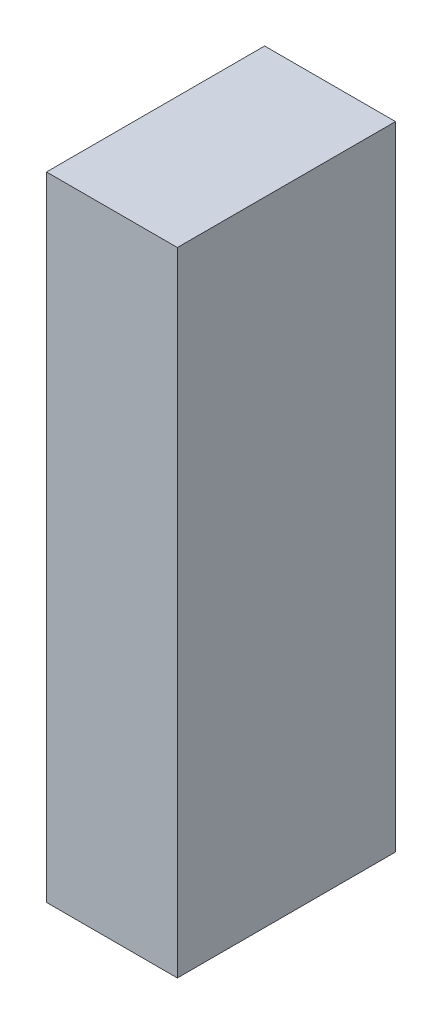
ISO-10303-21;
HEADER;
FILE_DESCRIPTION(('STEP AP214'),'2;1');
FILE_NAME('part.step','',(''),(''),'','','');
FILE_SCHEMA(('AUTOMOTIVE_DESIGN { 1 0 10303 214 1 1 1 1 }'));
ENDSEC;
DATA;
#1=APPLICATION_CONTEXT('core data for automotive mechanical design processes');
#2=APPLICATION_PROTOCOL_DEFINITION('international standard','automotive_design',2000,#1);
#3=PRODUCT_CONTEXT('',#1,'mechanical');
#4=PRODUCT('Part','Part','',(#3));
#5=PRODUCT_RELATED_PRODUCT_CATEGORY('part','',(#4));
#6=PRODUCT_DEFINITION_FORMATION('','',#4);
#7=PRODUCT_DEFINITION_CONTEXT('part definition',#1,'design');
#8=PRODUCT_DEFINITION('design','',#6,#7);
#9=PRODUCT_DEFINITION_SHAPE('','',#8);
#10=(LENGTH_UNIT() NAMED_UNIT(*) SI_UNIT(.MILLI.,.METRE.));
#11=(NAMED_UNIT(*) PLANE_ANGLE_UNIT() SI_UNIT($,.RADIAN.));
#12=(NAMED_UNIT(*) SI_UNIT($,.STERADIAN.) SOLID_ANGLE_UNIT());
#13=UNCERTAINTY_MEASURE_WITH_UNIT(LENGTH_MEASURE(1.E-05),#10,'distance_accuracy_value','');
#14=(GEOMETRIC_REPRESENTATION_CONTEXT(3) GLOBAL_UNCERTAINTY_ASSIGNED_CONTEXT((#13)) GLOBAL_UNIT_ASSIGNED_CONTEXT((#10,
#11,#12)) REPRESENTATION_CONTEXT('',''));
#15=CARTESIAN_POINT('',(0.,0.,0.));
#16=DIRECTION('',(0.,0.,1.));
#17=DIRECTION('',(1.,0.,0.));
#18=AXIS2_PLACEMENT_3D('',#15,#16,#17);
#19=CARTESIAN_POINT('',(0.800007905050762,-0.724997201263903,-2.64111989736557));
#20=DIRECTION('',(-8.74227765734759E-08,-1.,0.));
#21=DIRECTION('',(1.,-8.74227765734759E-08,0.));
#22=AXIS2_PLACEMENT_3D('',#19,#20,#21);
#23=PLANE('',#22);
#24=DIRECTION('',(0.999999999999996,-8.74227765127577E-08,0.));
#25=VECTOR('',#24,1.);
#26=CARTESIAN_POINT('',(0.800007905050762,-0.724997201263903,-2.64111989736557));
#27=LINE('',#26,#25);
#28=CARTESIAN_POINT('',(0.800007905050762,-0.724997201263903,-2.64111989736557));
#29=VERTEX_POINT('',#28);
#30=CARTESIAN_POINT('',(1.09999569801951,-0.724997227489666,-2.64111989736557));
#31=VERTEX_POINT('',#30);
#32=EDGE_CURVE('E11',#29,#31,#27,.T.);
#33=ORIENTED_EDGE('',*,*,#32,.T.);
#34=DIRECTION('',(0.,0.,1.));
#35=VECTOR('',#34,1.);
#36=CARTESIAN_POINT('',(1.09999569801951,-0.724997227489669,-2.64111989736557));
#37=LINE('',#36,#35);
#38=CARTESIAN_POINT('',(1.09999569801951,-0.724997227489666,-2.14112091064453));
#39=VERTEX_POINT('',#38);
#40=EDGE_CURVE('E88',#31,#39,#37,.T.);
#41=ORIENTED_EDGE('',*,*,#40,.T.);
#42=DIRECTION('',(0.999999999999996,-8.74227765127577E-08,0.));
#43=VECTOR('',#42,1.);
#44=CARTESIAN_POINT('',(0.800007905050762,-0.724997201263903,-2.14112091064453));
#45=LINE('',#44,#43);
#46=CARTESIAN_POINT('',(0.800007905050762,-0.724997201263903,-2.14112091064453));
#47=VERTEX_POINT('',#46);
#48=EDGE_CURVE('E83',#47,#39,#45,.T.);
#49=ORIENTED_EDGE('',*,*,#48,.F.);
#50=DIRECTION('',(0.,0.,1.));
#51=VECTOR('',#50,1.);
#52=CARTESIAN_POINT('',(0.800007905050747,-0.724997201263903,-2.64111989736557));
#53=LINE('',#52,#51);
#54=EDGE_CURVE('E72',#29,#47,#53,.T.);
#55=ORIENTED_EDGE('',*,*,#54,.F.);
#56=EDGE_LOOP('',(#33,#41,#49,#55));
#57=FACE_BOUND('',#56,.T.);
#58=ADVANCED_FACE('F17',(#57),#23,.T.);
#59=CARTESIAN_POINT('',(1.09999569801951,-0.724997227489666,-2.64111989736557));
#60=DIRECTION('',(1.,-8.74227765734759E-08,0.));
#61=DIRECTION('',(8.74227765734759E-08,1.,0.));
#62=AXIS2_PLACEMENT_3D('',#59,#60,#61);
#63=PLANE('',#62);
#64=DIRECTION('',(8.74227765590445E-08,0.999999999999996,0.));
#65=VECTOR('',#64,1.);
#66=CARTESIAN_POINT('',(1.09999569801951,-0.724997227489666,-2.64111989736557));
#67=LINE('',#66,#65);
#68=CARTESIAN_POINT('',(1.09999582478292,0.725007350147052,-2.64111989736557));
#69=VERTEX_POINT('',#68);
#70=EDGE_CURVE('E24',#31,#69,#67,.T.);
#71=ORIENTED_EDGE('',*,*,#70,.T.);
#72=DIRECTION('',(0.,0.,1.));
#73=VECTOR('',#72,1.);
#74=CARTESIAN_POINT('',(1.09999582478294,0.725007350147052,-2.64111989736557));
#75=LINE('',#74,#73);
#76=CARTESIAN_POINT('',(1.09999582478292,0.725007350147052,-2.14112091064453));
#77=VERTEX_POINT('',#76);
#78=EDGE_CURVE('E85',#69,#77,#75,.T.);
#79=ORIENTED_EDGE('',*,*,#78,.T.);
#80=DIRECTION('',(8.74227765590445E-08,0.999999999999996,0.));
#81=VECTOR('',#80,1.);
#82=CARTESIAN_POINT('',(1.09999569801951,-0.724997227489666,-2.14112091064453));
#83=LINE('',#82,#81);
#84=EDGE_CURVE('E66',#39,#77,#83,.T.);
#85=ORIENTED_EDGE('',*,*,#84,.F.);
#86=ORIENTED_EDGE('',*,*,#40,.F.);
#87=EDGE_LOOP('',(#71,#79,#85,#86));
#88=FACE_BOUND('',#87,.T.);
#89=ADVANCED_FACE('F89',(#88),#63,.T.);
#90=CARTESIAN_POINT('',(1.09999582478292,0.725007350147052,-2.64111989736557));
#91=DIRECTION('',(8.74227765734759E-08,1.,0.));
#92=DIRECTION('',(-1.,8.74227765734759E-08,0.));
#93=AXIS2_PLACEMENT_3D('',#90,#91,#92);
#94=PLANE('',#93);
#95=DIRECTION('',(-0.999999999999996,8.74227765127577E-08,0.));
#96=VECTOR('',#95,1.);
#97=CARTESIAN_POINT('',(1.09999582478292,0.725007350147052,-2.64111989736557));
#98=LINE('',#97,#96);
#99=CARTESIAN_POINT('',(0.800008031814173,0.725007376372815,-2.64111989736557));
#100=VERTEX_POINT('',#99);
#101=EDGE_CURVE('E62',#69,#100,#98,.T.);
#102=ORIENTED_EDGE('',*,*,#101,.T.);
#103=DIRECTION('',(0.,0.,1.));
#104=VECTOR('',#103,1.);
#105=CARTESIAN_POINT('',(0.800008031814173,0.725007376372818,-2.64111989736557));
#106=LINE('',#105,#104);
#107=CARTESIAN_POINT('',(0.800008031814173,0.725007376372815,-2.14112091064453));
#108=VERTEX_POINT('',#107);
#109=EDGE_CURVE('E55',#100,#108,#106,.T.);
#110=ORIENTED_EDGE('',*,*,#109,.T.);
#111=DIRECTION('',(-0.999999999999996,8.74227765127577E-08,0.));
#112=VECTOR('',#111,1.);
#113=CARTESIAN_POINT('',(1.09999582478292,0.725007350147052,-2.14112091064453));
#114=LINE('',#113,#112);
#115=EDGE_CURVE('E59',#77,#108,#114,.T.);
#116=ORIENTED_EDGE('',*,*,#115,.F.);
#117=ORIENTED_EDGE('',*,*,#78,.F.);
#118=EDGE_LOOP('',(#102,#110,#116,#117));
#119=FACE_BOUND('',#118,.T.);
#120=ADVANCED_FACE('F57',(#119),#94,.T.);
#121=CARTESIAN_POINT('',(0.800008031814173,0.725007376372815,-2.64111989736557));
#122=DIRECTION('',(-1.,8.74227765734759E-08,0.));
#123=DIRECTION('',(-8.74227765734759E-08,-1.,0.));
#124=AXIS2_PLACEMENT_3D('',#121,#122,#123);
#125=PLANE('',#124);
#126=DIRECTION('',(-8.74227765590445E-08,-0.999999999999996,0.));
#127=VECTOR('',#126,1.);
#128=CARTESIAN_POINT('',(0.800008031814173,0.725007376372815,-2.64111989736557));
#129=LINE('',#128,#127);
#130=EDGE_CURVE('E65',#100,#29,#129,.T.);
#131=ORIENTED_EDGE('',*,*,#130,.T.);
#132=ORIENTED_EDGE('',*,*,#54,.T.);
#133=DIRECTION('',(-8.74227765590445E-08,-0.999999999999996,0.));
#134=VECTOR('',#133,1.);
#135=CARTESIAN_POINT('',(0.800008031814173,0.725007376372815,-2.14112091064453));
#136=LINE('',#135,#134);
#137=EDGE_CURVE('E70',#108,#47,#136,.T.);
#138=ORIENTED_EDGE('',*,*,#137,.F.);
#139=ORIENTED_EDGE('',*,*,#109,.F.);
#140=EDGE_LOOP('',(#131,#132,#138,#139));
#141=FACE_BOUND('',#140,.T.);
#142=ADVANCED_FACE('F71',(#141),#125,.T.);
#143=CARTESIAN_POINT('',(189.900009155273,118.299987792969,-2.14112091064453));
#144=DIRECTION('',(0.,0.,1.));
#145=DIRECTION('',(-1.,8.74227765734759E-08,0.));
#146=AXIS2_PLACEMENT_3D('',#143,#144,#145);
#147=PLANE('',#146);
#148=ORIENTED_EDGE('',*,*,#48,.T.);
#149=ORIENTED_EDGE('',*,*,#84,.T.);
#150=ORIENTED_EDGE('',*,*,#115,.T.);
#151=ORIENTED_EDGE('',*,*,#137,.T.);
#152=EDGE_LOOP('',(#148,#149,#150,#151));
#153=FACE_BOUND('',#152,.T.);
#154=ADVANCED_FACE('F76',(#153),#147,.T.);
#155=CARTESIAN_POINT('',(189.900009155273,118.299987792969,-2.64111989736557));
#156=DIRECTION('',(0.,0.,1.));
#157=DIRECTION('',(-1.,8.74227765734759E-08,0.));
#158=AXIS2_PLACEMENT_3D('',#155,#156,#157);
#159=PLANE('',#158);
#160=ORIENTED_EDGE('',*,*,#130,.F.);
#161=ORIENTED_EDGE('',*,*,#101,.F.);
#162=ORIENTED_EDGE('',*,*,#70,.F.);
#163=ORIENTED_EDGE('',*,*,#32,.F.);
#164=EDGE_LOOP('',(#160,#161,#162,#163));
#165=FACE_BOUND('',#164,.T.);
#166=ADVANCED_FACE('F91',(#165),#159,.F.);
#167=CLOSED_SHELL('',(#58,#89,#120,#142,#154,#166));
#168=MANIFOLD_SOLID_BREP('B1',#167);
#169=ADVANCED_BREP_SHAPE_REPRESENTATION('',(#18,#168),#14);
#170=SHAPE_DEFINITION_REPRESENTATION(#9,#169);
ENDSEC;
END-ISO-10303-21;
